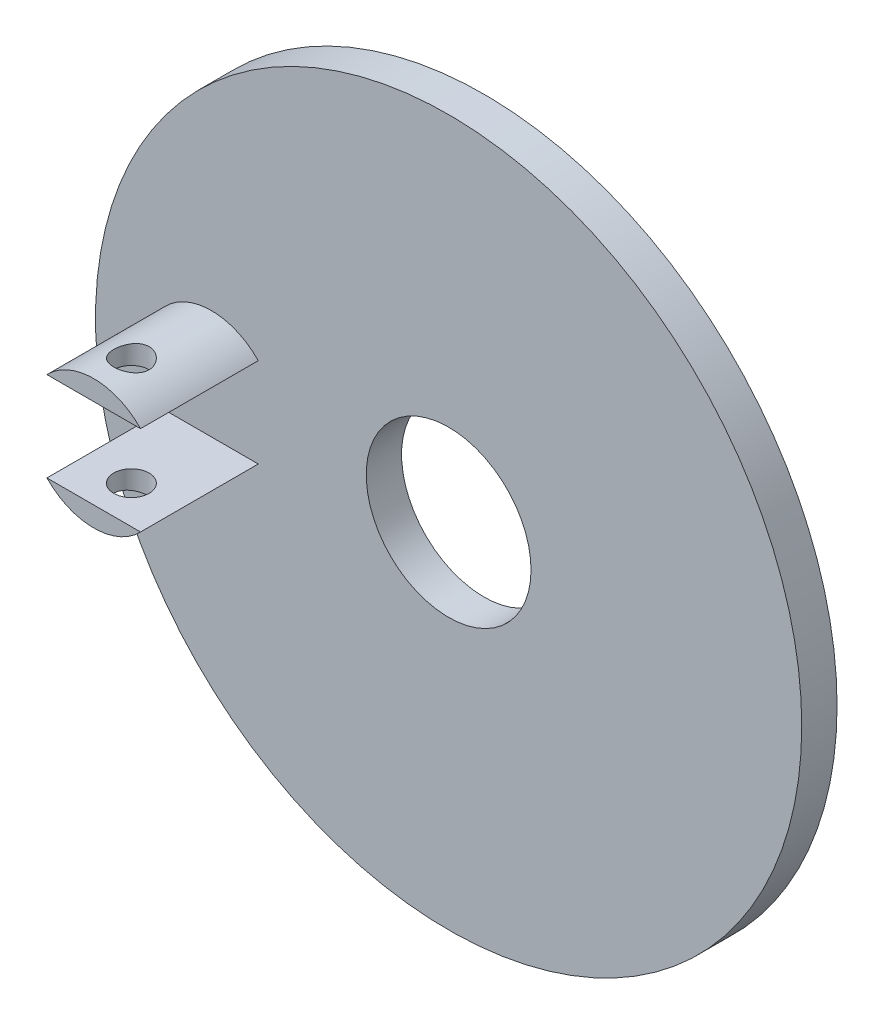
ISO-10303-21;
HEADER;
FILE_DESCRIPTION(('STEP AP214'),'2;1');
FILE_NAME('part.step','',(''),(''),'','','');
FILE_SCHEMA(('AUTOMOTIVE_DESIGN { 1 0 10303 214 1 1 1 1 }'));
ENDSEC;
DATA;
#1=APPLICATION_CONTEXT('core data for automotive mechanical design processes');
#2=APPLICATION_PROTOCOL_DEFINITION('international standard','automotive_design',2000,#1);
#3=PRODUCT_CONTEXT('',#1,'mechanical');
#4=PRODUCT('Part','Part','',(#3));
#5=PRODUCT_RELATED_PRODUCT_CATEGORY('part','',(#4));
#6=PRODUCT_DEFINITION_FORMATION('','',#4);
#7=PRODUCT_DEFINITION_CONTEXT('part definition',#1,'design');
#8=PRODUCT_DEFINITION('design','',#6,#7);
#9=PRODUCT_DEFINITION_SHAPE('','',#8);
#10=(LENGTH_UNIT() NAMED_UNIT(*) SI_UNIT(.MILLI.,.METRE.));
#11=(NAMED_UNIT(*) PLANE_ANGLE_UNIT() SI_UNIT($,.RADIAN.));
#12=(NAMED_UNIT(*) SI_UNIT($,.STERADIAN.) SOLID_ANGLE_UNIT());
#13=UNCERTAINTY_MEASURE_WITH_UNIT(LENGTH_MEASURE(1.E-05),#10,'distance_accuracy_value','');
#14=(GEOMETRIC_REPRESENTATION_CONTEXT(3) GLOBAL_UNCERTAINTY_ASSIGNED_CONTEXT((#13)) GLOBAL_UNIT_ASSIGNED_CONTEXT((#10,
#11,#12)) REPRESENTATION_CONTEXT('',''));
#15=CARTESIAN_POINT('',(0.,0.,0.));
#16=DIRECTION('',(0.,0.,1.));
#17=DIRECTION('',(1.,0.,0.));
#18=AXIS2_PLACEMENT_3D('',#15,#16,#17);
#19=CARTESIAN_POINT('',(-50.3744043567052,0.,32.5));
#20=DIRECTION('',(0.,0.,-1.));
#21=DIRECTION('',(-1.,0.,0.));
#22=AXIS2_PLACEMENT_3D('',#19,#20,#21);
#23=CYLINDRICAL_SURFACE('',#22,13.75);
#24=CARTESIAN_POINT('',(-50.3744043567052,13.75,28.25));
#25=CARTESIAN_POINT('',(-50.5809566400357,13.7499970679353,28.2499954684724));
#26=CARTESIAN_POINT('',(-50.787556803737,13.745300181519,28.2328773410415));
#27=CARTESIAN_POINT('',(-51.1947941820995,13.7270199521363,28.1649854242421));
#28=CARTESIAN_POINT('',(-51.3954286766484,13.7134326185125,28.1141965209285));
#29=CARTESIAN_POINT('',(-51.7847984218437,13.6788693043534,27.9807456706539));
#30=CARTESIAN_POINT('',(-51.9735490241306,13.6579030967349,27.8981258683452));
#31=CARTESIAN_POINT('',(-52.3345155971045,13.6107913603212,27.7035176683439));
#32=CARTESIAN_POINT('',(-52.5067302649297,13.5846454239129,27.5915269591152));
#33=CARTESIAN_POINT('',(-52.8338967256384,13.5292849260515,27.3385004088318));
#34=CARTESIAN_POINT('',(-52.9883921796301,13.5000160372607,27.1968863978645));
#35=CARTESIAN_POINT('',(-53.2717616987672,13.4420528233766,26.8898684099252));
#36=CARTESIAN_POINT('',(-53.4006323023233,13.4133585763801,26.7244612239942));
#37=CARTESIAN_POINT('',(-53.6313492201927,13.3592346040915,26.3708718810513));
#38=CARTESIAN_POINT('',(-53.7326650276449,13.3338732514656,26.1823321376593));
#39=CARTESIAN_POINT('',(-53.9019772657359,13.2900876852979,25.7900904295016));
#40=CARTESIAN_POINT('',(-53.9699801553763,13.2716621271439,25.5863914127788));
#41=CARTESIAN_POINT('',(-54.0691407677369,13.2443961798185,25.1746802624688));
#42=CARTESIAN_POINT('',(-54.101128370286,13.2353403070947,24.9668826295952));
#43=CARTESIAN_POINT('',(-54.1299384669336,13.2271957271021,24.548688292478));
#44=CARTESIAN_POINT('',(-54.1267678602273,13.2281050643315,24.33829210625));
#45=CARTESIAN_POINT('',(-54.0860091512128,13.2395956218864,23.9273961225843));
#46=CARTESIAN_POINT('',(-54.0494311984285,13.2498929578418,23.7267869134944));
#47=CARTESIAN_POINT('',(-53.9445164535004,13.2785438948515,23.334666784943));
#48=CARTESIAN_POINT('',(-53.8761770193214,13.2968981661038,23.1431566238343));
#49=CARTESIAN_POINT('',(-53.708870102367,13.3398404573081,22.7720661986314));
#50=CARTESIAN_POINT('',(-53.6095531537789,13.3644989941035,22.592651997416));
#51=CARTESIAN_POINT('',(-53.3833540572596,13.4172342199448,22.2526838814758));
#52=CARTESIAN_POINT('',(-53.2564662593605,13.4453116090812,22.0921338429031));
#53=CARTESIAN_POINT('',(-52.9735880237776,13.5028973747651,21.7886870254839));
#54=CARTESIAN_POINT('',(-52.8167509721234,13.5324218574279,21.6465813767777));
#55=CARTESIAN_POINT('',(-52.4811093861768,13.5887161926995,21.3905225875555));
#56=CARTESIAN_POINT('',(-52.3023039060016,13.6154859266073,21.2765706598759));
#57=CARTESIAN_POINT('',(-51.9265392410543,13.6634319530315,21.0796833180627));
#58=CARTESIAN_POINT('',(-51.7294984502497,13.6845812821826,20.9968966535401));
#59=CARTESIAN_POINT('',(-51.3235860784912,13.7187089035653,20.8658550687146));
#60=CARTESIAN_POINT('',(-51.1147172174994,13.7316890661141,20.8175922438897));
#61=CARTESIAN_POINT('',(-50.6978247829134,13.7477307194078,20.7582234555076));
#62=CARTESIAN_POINT('',(-50.4899651011652,13.7510790781342,20.7460425116991));
#63=CARTESIAN_POINT('',(-50.0751709426103,13.7483075396284,20.7562068687836));
#64=CARTESIAN_POINT('',(-49.868236367874,13.7421886695752,20.7785484240412));
#65=CARTESIAN_POINT('',(-49.4650416123563,13.7213559816487,20.8562437567578));
#66=CARTESIAN_POINT('',(-49.2686560460236,13.7067996618024,20.9109929818925));
#67=CARTESIAN_POINT('',(-48.8878796880836,13.6707480883919,21.0512431116013));
#68=CARTESIAN_POINT('',(-48.7034902284427,13.6492520658647,21.1367474241534));
#69=CARTESIAN_POINT('',(-48.3478014537188,13.6010393457039,21.338041105714));
#70=CARTESIAN_POINT('',(-48.176842850674,13.5742257387359,21.4544087181532));
#71=CARTESIAN_POINT('',(-47.8565038063779,13.518474710262,21.7134032188638));
#72=CARTESIAN_POINT('',(-47.7071278412602,13.4895368500677,21.8560355403964));
#73=CARTESIAN_POINT('',(-47.4296278480984,13.4317350389196,22.1685350950846));
#74=CARTESIAN_POINT('',(-47.3022636630283,13.4028986244354,22.3390834556873));
#75=CARTESIAN_POINT('',(-47.0779398015026,13.3495006548571,22.6997466180582));
#76=CARTESIAN_POINT('',(-46.9809789085436,13.3249389287407,22.8898606365564));
#77=CARTESIAN_POINT('',(-46.8209403987832,13.2831562169934,23.2833515705805));
#78=CARTESIAN_POINT('',(-46.7576705490722,13.2658937028182,23.4866456512007));
#79=CARTESIAN_POINT('',(-46.6663814262294,13.2406703654265,23.9015420949445));
#80=CARTESIAN_POINT('',(-46.6383526351345,13.2327070307137,24.1131421988357));
#81=CARTESIAN_POINT('',(-46.6189069672749,13.2272002418744,24.5308460095882));
#82=CARTESIAN_POINT('',(-46.6262660262878,13.2293083985106,24.7368889718698));
#83=CARTESIAN_POINT('',(-46.6745334156185,13.2428875416135,25.144676619382));
#84=CARTESIAN_POINT('',(-46.7154408059924,13.2543582657633,25.3464214248743));
#85=CARTESIAN_POINT('',(-46.8289191458226,13.2851579127739,25.7382657894222));
#86=CARTESIAN_POINT('',(-46.9012194704758,13.3044195782739,25.9284493830995));
#87=CARTESIAN_POINT('',(-47.0752217431718,13.3486297495706,26.2941331920382));
#88=CARTESIAN_POINT('',(-47.1769284940942,13.3735791841958,26.4696310026642));
#89=CARTESIAN_POINT('',(-47.4105185820836,13.4273094845813,26.8067764942303));
#90=CARTESIAN_POINT('',(-47.543231811152,13.4561843961411,26.9678342621074));
#91=CARTESIAN_POINT('',(-47.8335040767235,13.5139997622617,27.2657910169869));
#92=CARTESIAN_POINT('',(-47.9910692082353,13.54294023118,27.4026840600134));
#93=CARTESIAN_POINT('',(-48.33088504249,13.5984114794366,27.6514865362984));
#94=CARTESIAN_POINT('',(-48.5136146910489,13.6248726938459,27.7627587021674));
#95=CARTESIAN_POINT('',(-48.895904607107,13.6716315945094,27.9528310905287));
#96=CARTESIAN_POINT('',(-49.0954544756522,13.6919330537798,28.0316512013858));
#97=CARTESIAN_POINT('',(-49.4741541036597,13.7216048498941,28.1448487749475));
#98=CARTESIAN_POINT('',(-49.6517427560491,13.7321736920273,28.1841863781043));
#99=CARTESIAN_POINT('',(-50.0110103368515,13.7463721791088,28.2367625632971));
#100=CARTESIAN_POINT('',(-50.1926888177929,13.7500025795005,28.250003986637));
#101=CARTESIAN_POINT('',(-50.3744043567052,13.75,28.25));
#102=B_SPLINE_CURVE_WITH_KNOTS('',3,(#24,#25,#26,#27,#28,#29,#30,#31,#32,#33,#34,#35,#36,#37,
#38,#39,#40,#41,#42,#43,#44,#45,#46,#47,#48,#49,#50,#51,#52,#53,#54,#55,#56,#57,#58,#59,#60,#61,
#62,#63,#64,#65,#66,#67,#68,#69,#70,#71,#72,#73,#74,#75,#76,#77,#78,#79,#80,#81,#82,#83,#84,#85,
#86,#87,#88,#89,#90,#91,#92,#93,#94,#95,#96,#97,#98,#99,#100,#101),.UNSPECIFIED.,.T.,.F.,(4,2,2,
2,2,2,2,2,2,2,2,2,2,2,2,2,2,2,2,2,2,2,2,2,2,2,2,2,2,2,2,2,2,2,2,2,2,2,4),(0.,0.618990267137247,
1.23825857137825,1.85670975605145,2.47520962841177,3.10714695557947,3.73916959148309,
4.38261484125548,5.02593528477491,5.65410762152314,6.28215669241344,6.89182216687217,
7.50153836459292,8.1183981691982,8.73538450347804,9.37346321376938,10.0115694071106,
10.6526837434007,11.2936512441736,11.9153202835771,12.5369218776313,13.1472777800049,
13.7577013368959,14.380486725242,15.0034010914001,15.6447518266217,16.2860768966978,
16.9237024114271,17.5611556781934,18.1767213058417,18.7922696874019,19.4026138915576,
20.0130578381019,20.6422252849645,21.2715472777866,21.9151468073887,22.5583513153481,
23.102970802492,23.6475309891948),.UNSPECIFIED.);
#103=CARTESIAN_POINT('',(-50.3744043567052,13.75,28.25));
#104=VERTEX_POINT('',#103);
#105=EDGE_CURVE('E157',#104,#104,#102,.T.);
#106=ORIENTED_EDGE('',*,*,#105,.T.);
#107=EDGE_LOOP('',(#106));
#108=FACE_BOUND('',#107,.T.);
#109=DIRECTION('',(0.,0.,1.));
#110=VECTOR('',#109,1.);
#111=CARTESIAN_POINT('',(-60.3148520327408,9.5,-206.753354699524));
#112=LINE('',#111,#110);
#113=CARTESIAN_POINT('',(-60.3148520327408,9.5,7.50000000000001));
#114=VERTEX_POINT('',#113);
#115=CARTESIAN_POINT('',(-60.3148520327408,9.5,32.5));
#116=VERTEX_POINT('',#115);
#117=EDGE_CURVE('E93',#114,#116,#112,.T.);
#118=ORIENTED_EDGE('',*,*,#117,.T.);
#119=CARTESIAN_POINT('',(-50.3744043567052,0.,32.5));
#120=DIRECTION('',(0.,0.,1.));
#121=DIRECTION('',(1.,0.,0.));
#122=AXIS2_PLACEMENT_3D('',#119,#120,#121);
#123=CIRCLE('',#122,13.75);
#124=CARTESIAN_POINT('',(-40.4339566806697,9.5,32.5));
#125=VERTEX_POINT('',#124);
#126=EDGE_CURVE('E98',#125,#116,#123,.T.);
#127=ORIENTED_EDGE('',*,*,#126,.F.);
#128=DIRECTION('',(0.,0.,1.));
#129=VECTOR('',#128,1.);
#130=CARTESIAN_POINT('',(-40.4339566806697,9.5,-206.753354699524));
#131=LINE('',#130,#129);
#132=CARTESIAN_POINT('',(-40.4339566806697,9.5,7.50000000000001));
#133=VERTEX_POINT('',#132);
#134=EDGE_CURVE('E82',#133,#125,#131,.T.);
#135=ORIENTED_EDGE('',*,*,#134,.F.);
#136=CARTESIAN_POINT('',(-50.3744043567052,0.,7.5));
#137=DIRECTION('',(0.,0.,1.));
#138=DIRECTION('',(1.,0.,0.));
#139=AXIS2_PLACEMENT_3D('',#136,#137,#138);
#140=CIRCLE('',#139,13.75);
#141=EDGE_CURVE('E107',#133,#114,#140,.T.);
#142=ORIENTED_EDGE('',*,*,#141,.T.);
#143=EDGE_LOOP('',(#118,#127,#135,#142));
#144=FACE_BOUND('',#143,.T.);
#145=ADVANCED_FACE('F42',(#108,#144),#23,.T.);
#146=CARTESIAN_POINT('',(-50.3744043567052,-13.75,28.25));
#147=CARTESIAN_POINT('',(-50.1678520733747,-13.7499970679353,28.2499954684724));
#148=CARTESIAN_POINT('',(-49.9612519096735,-13.745300181519,28.2328773410415));
#149=CARTESIAN_POINT('',(-49.554014531311,-13.7270199521363,28.1649854242421));
#150=CARTESIAN_POINT('',(-49.3533800367621,-13.7134326185125,28.1141965209285));
#151=CARTESIAN_POINT('',(-48.9640102915667,-13.6788693043534,27.9807456706539));
#152=CARTESIAN_POINT('',(-48.7752596892798,-13.6579030967349,27.8981258683452));
#153=CARTESIAN_POINT('',(-48.4142931163059,-13.6107913603212,27.7035176683439));
#154=CARTESIAN_POINT('',(-48.2420784484808,-13.5846454239129,27.5915269591152));
#155=CARTESIAN_POINT('',(-47.9149119877721,-13.5292849260515,27.3385004088318));
#156=CARTESIAN_POINT('',(-47.7604165337804,-13.5000160372607,27.1968863978645));
#157=CARTESIAN_POINT('',(-47.4770470146433,-13.4420528233766,26.8898684099252));
#158=CARTESIAN_POINT('',(-47.3481764110872,-13.4133585763801,26.7244612239942));
#159=CARTESIAN_POINT('',(-47.1174594932178,-13.3592346040915,26.3708718810513));
#160=CARTESIAN_POINT('',(-47.0161436857656,-13.3338732514656,26.1823321376593));
#161=CARTESIAN_POINT('',(-46.8468314476745,-13.2900876852979,25.7900904295016));
#162=CARTESIAN_POINT('',(-46.7788285580341,-13.2716621271439,25.5863914127788));
#163=CARTESIAN_POINT('',(-46.6796679456735,-13.2443961798185,25.1746802624688));
#164=CARTESIAN_POINT('',(-46.6476803431245,-13.2353403070947,24.9668826295952));
#165=CARTESIAN_POINT('',(-46.6188702464769,-13.2271957271021,24.548688292478));
#166=CARTESIAN_POINT('',(-46.6220408531832,-13.2281050643315,24.33829210625));
#167=CARTESIAN_POINT('',(-46.6627995621977,-13.2395956218864,23.9273961225843));
#168=CARTESIAN_POINT('',(-46.6993775149819,-13.2498929578418,23.7267869134944));
#169=CARTESIAN_POINT('',(-46.8042922599101,-13.2785438948515,23.334666784943));
#170=CARTESIAN_POINT('',(-46.8726316940891,-13.2968981661038,23.1431566238343));
#171=CARTESIAN_POINT('',(-47.0399386110435,-13.3398404573081,22.7720661986314));
#172=CARTESIAN_POINT('',(-47.1392555596316,-13.3644989941035,22.592651997416));
#173=CARTESIAN_POINT('',(-47.3654546561509,-13.4172342199448,22.2526838814758));
#174=CARTESIAN_POINT('',(-47.49234245405,-13.4453116090812,22.0921338429031));
#175=CARTESIAN_POINT('',(-47.7752206896328,-13.5028973747651,21.7886870254839));
#176=CARTESIAN_POINT('',(-47.9320577412871,-13.5324218574279,21.6465813767777));
#177=CARTESIAN_POINT('',(-48.2676993272337,-13.5887161926995,21.3905225875555));
#178=CARTESIAN_POINT('',(-48.4465048074089,-13.6154859266073,21.2765706598759));
#179=CARTESIAN_POINT('',(-48.8222694723562,-13.6634319530315,21.0796833180627));
#180=CARTESIAN_POINT('',(-49.0193102631608,-13.6845812821826,20.9968966535401));
#181=CARTESIAN_POINT('',(-49.4252226349193,-13.7187089035653,20.8658550687146));
#182=CARTESIAN_POINT('',(-49.634091495911,-13.7316890661141,20.8175922438897));
#183=CARTESIAN_POINT('',(-50.0509839304971,-13.7477307194078,20.7582234555076));
#184=CARTESIAN_POINT('',(-50.2588436122453,-13.7510790781342,20.7460425116991));
#185=CARTESIAN_POINT('',(-50.6736377708002,-13.7483075396284,20.7562068687836));
#186=CARTESIAN_POINT('',(-50.8805723455365,-13.7421886695752,20.7785484240412));
#187=CARTESIAN_POINT('',(-51.2837671010541,-13.7213559816487,20.8562437567578));
#188=CARTESIAN_POINT('',(-51.4801526673869,-13.7067996618024,20.9109929818925));
#189=CARTESIAN_POINT('',(-51.8609290253268,-13.6707480883919,21.0512431116013));
#190=CARTESIAN_POINT('',(-52.0453184849678,-13.6492520658647,21.1367474241534));
#191=CARTESIAN_POINT('',(-52.4010072596916,-13.6010393457039,21.338041105714));
#192=CARTESIAN_POINT('',(-52.5719658627364,-13.5742257387359,21.4544087181532));
#193=CARTESIAN_POINT('',(-52.8923049070325,-13.518474710262,21.7134032188638));
#194=CARTESIAN_POINT('',(-53.0416808721502,-13.4895368500677,21.8560355403964));
#195=CARTESIAN_POINT('',(-53.3191808653121,-13.4317350389196,22.1685350950846));
#196=CARTESIAN_POINT('',(-53.4465450503822,-13.4028986244354,22.3390834556873));
#197=CARTESIAN_POINT('',(-53.6708689119078,-13.3495006548571,22.6997466180582));
#198=CARTESIAN_POINT('',(-53.7678298048668,-13.3249389287407,22.8898606365564));
#199=CARTESIAN_POINT('',(-53.9278683146273,-13.2831562169934,23.2833515705805));
#200=CARTESIAN_POINT('',(-53.9911381643382,-13.2658937028182,23.4866456512007));
#201=CARTESIAN_POINT('',(-54.0824272871811,-13.2406703654265,23.9015420949445));
#202=CARTESIAN_POINT('',(-54.110456078276,-13.2327070307137,24.1131421988357));
#203=CARTESIAN_POINT('',(-54.1299017461355,-13.2272002418744,24.5308460095882));
#204=CARTESIAN_POINT('',(-54.1225426871227,-13.2293083985106,24.7368889718698));
#205=CARTESIAN_POINT('',(-54.0742752977919,-13.2428875416135,25.144676619382));
#206=CARTESIAN_POINT('',(-54.0333679074181,-13.2543582657633,25.3464214248743));
#207=CARTESIAN_POINT('',(-53.9198895675879,-13.2851579127739,25.7382657894222));
#208=CARTESIAN_POINT('',(-53.8475892429347,-13.3044195782739,25.9284493830995));
#209=CARTESIAN_POINT('',(-53.6735869702386,-13.3486297495706,26.2941331920382));
#210=CARTESIAN_POINT('',(-53.5718802193163,-13.3735791841958,26.4696310026642));
#211=CARTESIAN_POINT('',(-53.3382901313269,-13.4273094845813,26.8067764942303));
#212=CARTESIAN_POINT('',(-53.2055769022584,-13.4561843961411,26.9678342621074));
#213=CARTESIAN_POINT('',(-52.915304636687,-13.5139997622617,27.2657910169869));
#214=CARTESIAN_POINT('',(-52.7577395051752,-13.54294023118,27.4026840600134));
#215=CARTESIAN_POINT('',(-52.4179236709205,-13.5984114794366,27.6514865362984));
#216=CARTESIAN_POINT('',(-52.2351940223615,-13.6248726938459,27.7627587021674));
#217=CARTESIAN_POINT('',(-51.8529041063034,-13.6716315945094,27.9528310905287));
#218=CARTESIAN_POINT('',(-51.6533542377583,-13.6919330537798,28.0316512013858));
#219=CARTESIAN_POINT('',(-51.2746546097508,-13.7216048498941,28.1448487749475));
#220=CARTESIAN_POINT('',(-51.0970659573614,-13.7321736920273,28.1841863781043));
#221=CARTESIAN_POINT('',(-50.7377983765589,-13.7463721791088,28.2367625632971));
#222=CARTESIAN_POINT('',(-50.5561198956176,-13.7500025795005,28.250003986637));
#223=CARTESIAN_POINT('',(-50.3744043567052,-13.75,28.25));
#224=B_SPLINE_CURVE_WITH_KNOTS('',3,(#146,#147,#148,#149,#150,#151,#152,#153,#154,#155,#156,
#157,#158,#159,#160,#161,#162,#163,#164,#165,#166,#167,#168,#169,#170,#171,#172,#173,#174,#175,
#176,#177,#178,#179,#180,#181,#182,#183,#184,#185,#186,#187,#188,#189,#190,#191,#192,#193,#194,
#195,#196,#197,#198,#199,#200,#201,#202,#203,#204,#205,#206,#207,#208,#209,#210,#211,#212,#213,
#214,#215,#216,#217,#218,#219,#220,#221,#222,#223),.UNSPECIFIED.,.T.,.F.,(4,2,2,2,2,2,2,2,2,2,2,
2,2,2,2,2,2,2,2,2,2,2,2,2,2,2,2,2,2,2,2,2,2,2,2,2,2,2,4),(0.,0.618990267137247,1.23825857137825,
1.85670975605145,2.47520962841177,3.10714695557946,3.73916959148309,4.38261484125548,
5.02593528477491,5.65410762152314,6.28215669241344,6.89182216687217,7.50153836459292,
8.1183981691982,8.73538450347803,9.37346321376937,10.0115694071106,10.6526837434007,
11.2936512441736,11.9153202835771,12.5369218776313,13.1472777800049,13.7577013368959,
14.380486725242,15.0034010914001,15.6447518266217,16.2860768966978,16.9237024114271,
17.5611556781934,18.1767213058417,18.7922696874019,19.4026138915576,20.0130578381019,
20.6422252849645,21.2715472777866,21.9151468073887,22.5583513153481,23.102970802492,
23.6475309891948),.UNSPECIFIED.);
#225=CARTESIAN_POINT('',(-50.3744043567052,-13.75,28.25));
#226=VERTEX_POINT('',#225);
#227=EDGE_CURVE('E150',#226,#226,#224,.T.);
#228=ORIENTED_EDGE('',*,*,#227,.T.);
#229=EDGE_LOOP('',(#228));
#230=FACE_BOUND('',#229,.T.);
#231=DIRECTION('',(0.,0.,1.));
#232=VECTOR('',#231,1.);
#233=CARTESIAN_POINT('',(-40.4339566806697,-9.5,-206.753354699524));
#234=LINE('',#233,#232);
#235=CARTESIAN_POINT('',(-40.4339566806697,-9.5,7.50000000000001));
#236=VERTEX_POINT('',#235);
#237=CARTESIAN_POINT('',(-40.4339566806697,-9.5,32.5));
#238=VERTEX_POINT('',#237);
#239=EDGE_CURVE('E189',#236,#238,#234,.T.);
#240=ORIENTED_EDGE('',*,*,#239,.T.);
#241=CARTESIAN_POINT('',(-60.3148520327408,-9.5,32.5));
#242=VERTEX_POINT('',#241);
#243=EDGE_CURVE('E101',#242,#238,#123,.T.);
#244=ORIENTED_EDGE('',*,*,#243,.F.);
#245=DIRECTION('',(0.,0.,1.));
#246=VECTOR('',#245,1.);
#247=CARTESIAN_POINT('',(-60.3148520327408,-9.5,-206.753354699524));
#248=LINE('',#247,#246);
#249=CARTESIAN_POINT('',(-60.3148520327408,-9.5,7.50000000000001));
#250=VERTEX_POINT('',#249);
#251=EDGE_CURVE('E59',#250,#242,#248,.T.);
#252=ORIENTED_EDGE('',*,*,#251,.F.);
#253=EDGE_CURVE('E112',#250,#236,#140,.T.);
#254=ORIENTED_EDGE('',*,*,#253,.T.);
#255=EDGE_LOOP('',(#240,#244,#252,#254));
#256=FACE_BOUND('',#255,.T.);
#257=ADVANCED_FACE('F139',(#230,#256),#23,.T.);
#258=CARTESIAN_POINT('',(-50.3744043567052,0.,32.5));
#259=DIRECTION('',(0.,0.,1.));
#260=DIRECTION('',(1.,0.,0.));
#261=AXIS2_PLACEMENT_3D('',#258,#259,#260);
#262=PLANE('',#261);
#263=ORIENTED_EDGE('',*,*,#126,.T.);
#264=DIRECTION('',(1.,0.,0.));
#265=VECTOR('',#264,1.);
#266=CARTESIAN_POINT('',(-60.3148520327408,9.5,32.5));
#267=LINE('',#266,#265);
#268=EDGE_CURVE('E85',#116,#125,#267,.T.);
#269=ORIENTED_EDGE('',*,*,#268,.T.);
#270=EDGE_LOOP('',(#263,#269));
#271=FACE_BOUND('',#270,.T.);
#272=ADVANCED_FACE('F97',(#271),#262,.T.);
#273=ORIENTED_EDGE('',*,*,#243,.T.);
#274=DIRECTION('',(-1.,0.,0.));
#275=VECTOR('',#274,1.);
#276=CARTESIAN_POINT('',(-60.3148520327408,-9.5,32.5));
#277=LINE('',#276,#275);
#278=EDGE_CURVE('E162',#238,#242,#277,.T.);
#279=ORIENTED_EDGE('',*,*,#278,.T.);
#280=EDGE_LOOP('',(#273,#279));
#281=FACE_BOUND('',#280,.T.);
#282=ADVANCED_FACE('F193',(#281),#262,.T.);
#283=CARTESIAN_POINT('',(0.,0.,7.5));
#284=DIRECTION('',(0.,0.,1.));
#285=DIRECTION('',(1.,0.,0.));
#286=AXIS2_PLACEMENT_3D('',#283,#284,#285);
#287=PLANE('',#286);
#288=ORIENTED_EDGE('',*,*,#253,.F.);
#289=DIRECTION('',(1.,0.,0.));
#290=VECTOR('',#289,1.);
#291=CARTESIAN_POINT('',(-60.3148520327408,-9.5,7.50000000000001));
#292=LINE('',#291,#290);
#293=EDGE_CURVE('E65',#250,#236,#292,.T.);
#294=ORIENTED_EDGE('',*,*,#293,.T.);
#295=EDGE_LOOP('',(#288,#294));
#296=FACE_BOUND('',#295,.T.);
#297=ORIENTED_EDGE('',*,*,#141,.F.);
#298=DIRECTION('',(-1.,0.,0.));
#299=VECTOR('',#298,1.);
#300=CARTESIAN_POINT('',(-60.3148520327408,9.5,7.50000000000001));
#301=LINE('',#300,#299);
#302=EDGE_CURVE('E88',#133,#114,#301,.T.);
#303=ORIENTED_EDGE('',*,*,#302,.T.);
#304=EDGE_LOOP('',(#297,#303));
#305=FACE_BOUND('',#304,.T.);
#306=CARTESIAN_POINT('',(0.,0.,7.5));
#307=DIRECTION('',(0.,0.,1.));
#308=DIRECTION('',(1.,0.,0.));
#309=AXIS2_PLACEMENT_3D('',#306,#307,#308);
#310=CIRCLE('',#309,75.);
#311=CARTESIAN_POINT('',(75.,0.,7.5));
#312=VERTEX_POINT('',#311);
#313=EDGE_CURVE('E12',#312,#312,#310,.T.);
#314=ORIENTED_EDGE('',*,*,#313,.T.);
#315=EDGE_LOOP('',(#314));
#316=FACE_BOUND('',#315,.T.);
#317=CARTESIAN_POINT('',(0.,0.,7.5));
#318=DIRECTION('',(0.,0.,1.));
#319=DIRECTION('',(1.,0.,0.));
#320=AXIS2_PLACEMENT_3D('',#317,#318,#319);
#321=CIRCLE('',#320,17.5);
#322=CARTESIAN_POINT('',(17.5,0.,7.5));
#323=VERTEX_POINT('',#322);
#324=EDGE_CURVE('E104',#323,#323,#321,.T.);
#325=ORIENTED_EDGE('',*,*,#324,.F.);
#326=EDGE_LOOP('',(#325));
#327=FACE_BOUND('',#326,.T.);
#328=ADVANCED_FACE('F121',(#296,#305,#316,#327),#287,.T.);
#329=CARTESIAN_POINT('',(0.,0.,0.));
#330=DIRECTION('',(0.,0.,1.));
#331=DIRECTION('',(1.,0.,0.));
#332=AXIS2_PLACEMENT_3D('',#329,#330,#331);
#333=PLANE('',#332);
#334=CARTESIAN_POINT('',(0.,0.,0.));
#335=DIRECTION('',(0.,0.,1.));
#336=DIRECTION('',(1.,0.,0.));
#337=AXIS2_PLACEMENT_3D('',#334,#335,#336);
#338=CIRCLE('',#337,75.);
#339=CARTESIAN_POINT('',(75.,0.,0.));
#340=VERTEX_POINT('',#339);
#341=EDGE_CURVE('E51',#340,#340,#338,.T.);
#342=ORIENTED_EDGE('',*,*,#341,.F.);
#343=EDGE_LOOP('',(#342));
#344=FACE_BOUND('',#343,.T.);
#345=CARTESIAN_POINT('',(0.,0.,0.));
#346=DIRECTION('',(0.,0.,1.));
#347=DIRECTION('',(1.,0.,0.));
#348=AXIS2_PLACEMENT_3D('',#345,#346,#347);
#349=CIRCLE('',#348,17.5);
#350=CARTESIAN_POINT('',(17.5,0.,0.));
#351=VERTEX_POINT('',#350);
#352=EDGE_CURVE('E100',#351,#351,#349,.T.);
#353=ORIENTED_EDGE('',*,*,#352,.T.);
#354=EDGE_LOOP('',(#353));
#355=FACE_BOUND('',#354,.T.);
#356=ADVANCED_FACE('F118',(#344,#355),#333,.F.);
#357=CARTESIAN_POINT('',(0.,0.,7.5));
#358=DIRECTION('',(0.,0.,-1.));
#359=DIRECTION('',(-1.,0.,0.));
#360=AXIS2_PLACEMENT_3D('',#357,#358,#359);
#361=CYLINDRICAL_SURFACE('',#360,75.);
#362=ORIENTED_EDGE('',*,*,#313,.F.);
#363=EDGE_LOOP('',(#362));
#364=FACE_BOUND('',#363,.T.);
#365=ORIENTED_EDGE('',*,*,#341,.T.);
#366=EDGE_LOOP('',(#365));
#367=FACE_BOUND('',#366,.T.);
#368=ADVANCED_FACE('F44',(#364,#367),#361,.T.);
#369=CARTESIAN_POINT('',(0.,0.,7.5));
#370=DIRECTION('',(0.,0.,-1.));
#371=DIRECTION('',(-1.,0.,0.));
#372=AXIS2_PLACEMENT_3D('',#369,#370,#371);
#373=CYLINDRICAL_SURFACE('',#372,17.5);
#374=ORIENTED_EDGE('',*,*,#324,.T.);
#375=EDGE_LOOP('',(#374));
#376=FACE_BOUND('',#375,.T.);
#377=ORIENTED_EDGE('',*,*,#352,.F.);
#378=EDGE_LOOP('',(#377));
#379=FACE_BOUND('',#378,.T.);
#380=ADVANCED_FACE('F124',(#376,#379),#373,.F.);
#381=CARTESIAN_POINT('',(-60.3148520327408,9.5,-206.753354699524));
#382=DIRECTION('',(0.,-1.,0.));
#383=DIRECTION('',(0.,0.,-1.));
#384=AXIS2_PLACEMENT_3D('',#381,#382,#383);
#385=PLANE('',#384);
#386=CARTESIAN_POINT('',(-50.3744043567052,9.49999999999999,24.5));
#387=DIRECTION('',(0.,-1.,0.));
#388=DIRECTION('',(0.,0.,-1.));
#389=AXIS2_PLACEMENT_3D('',#386,#387,#388);
#390=CIRCLE('',#389,3.75);
#391=CARTESIAN_POINT('',(-50.3744043567052,9.49999999999999,20.75));
#392=VERTEX_POINT('',#391);
#393=EDGE_CURVE('E179',#392,#392,#390,.T.);
#394=ORIENTED_EDGE('',*,*,#393,.F.);
#395=EDGE_LOOP('',(#394));
#396=FACE_BOUND('',#395,.T.);
#397=ORIENTED_EDGE('',*,*,#134,.T.);
#398=ORIENTED_EDGE('',*,*,#268,.F.);
#399=ORIENTED_EDGE('',*,*,#117,.F.);
#400=ORIENTED_EDGE('',*,*,#302,.F.);
#401=EDGE_LOOP('',(#397,#398,#399,#400));
#402=FACE_BOUND('',#401,.T.);
#403=ADVANCED_FACE('F84',(#396,#402),#385,.T.);
#404=CARTESIAN_POINT('',(-60.3148520327408,-9.5,-206.753354699524));
#405=DIRECTION('',(0.,1.,0.));
#406=DIRECTION('',(0.,0.,1.));
#407=AXIS2_PLACEMENT_3D('',#404,#405,#406);
#408=PLANE('',#407);
#409=CARTESIAN_POINT('',(-50.3744043567052,-9.49999999999999,24.5));
#410=DIRECTION('',(0.,1.,0.));
#411=DIRECTION('',(0.,0.,1.));
#412=AXIS2_PLACEMENT_3D('',#409,#410,#411);
#413=CIRCLE('',#412,3.75);
#414=CARTESIAN_POINT('',(-50.3744043567052,-9.49999999999999,28.25));
#415=VERTEX_POINT('',#414);
#416=EDGE_CURVE('E46',#415,#415,#413,.T.);
#417=ORIENTED_EDGE('',*,*,#416,.F.);
#418=EDGE_LOOP('',(#417));
#419=FACE_BOUND('',#418,.T.);
#420=ORIENTED_EDGE('',*,*,#251,.T.);
#421=ORIENTED_EDGE('',*,*,#278,.F.);
#422=ORIENTED_EDGE('',*,*,#239,.F.);
#423=ORIENTED_EDGE('',*,*,#293,.F.);
#424=EDGE_LOOP('',(#420,#421,#422,#423));
#425=FACE_BOUND('',#424,.T.);
#426=ADVANCED_FACE('F132',(#419,#425),#408,.T.);
#427=CARTESIAN_POINT('',(-50.3744043567052,-75.,24.5));
#428=DIRECTION('',(0.,1.,0.));
#429=DIRECTION('',(0.,0.,1.));
#430=AXIS2_PLACEMENT_3D('',#427,#428,#429);
#431=CYLINDRICAL_SURFACE('',#430,3.75);
#432=ORIENTED_EDGE('',*,*,#416,.T.);
#433=EDGE_LOOP('',(#432));
#434=FACE_BOUND('',#433,.T.);
#435=ORIENTED_EDGE('',*,*,#227,.F.);
#436=EDGE_LOOP('',(#435));
#437=FACE_BOUND('',#436,.T.);
#438=ADVANCED_FACE('F168',(#434,#437),#431,.F.);
#439=ORIENTED_EDGE('',*,*,#393,.T.);
#440=EDGE_LOOP('',(#439));
#441=FACE_BOUND('',#440,.T.);
#442=ORIENTED_EDGE('',*,*,#105,.F.);
#443=EDGE_LOOP('',(#442));
#444=FACE_BOUND('',#443,.T.);
#445=ADVANCED_FACE('F164',(#441,#444),#431,.F.);
#446=CLOSED_SHELL('',(#145,#257,#272,#282,#328,#356,#368,#380,#403,#426,#438,#445));
#447=MANIFOLD_SOLID_BREP('B2',#446);
#448=ADVANCED_BREP_SHAPE_REPRESENTATION('',(#18,#447),#14);
#449=SHAPE_DEFINITION_REPRESENTATION(#9,#448);
ENDSEC;
END-ISO-10303-21;
